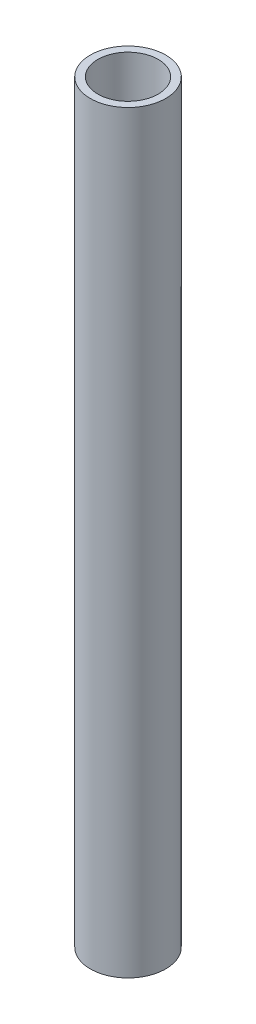
ISO-10303-21;
HEADER;
FILE_DESCRIPTION(('STEP AP214'),'2;1');
FILE_NAME('part.step','',(''),(''),'','','');
FILE_SCHEMA(('AUTOMOTIVE_DESIGN { 1 0 10303 214 1 1 1 1 }'));
ENDSEC;
DATA;
#1=APPLICATION_CONTEXT('core data for automotive mechanical design processes');
#2=APPLICATION_PROTOCOL_DEFINITION('international standard','automotive_design',2000,#1);
#3=PRODUCT_CONTEXT('',#1,'mechanical');
#4=PRODUCT('Part','Part','',(#3));
#5=PRODUCT_RELATED_PRODUCT_CATEGORY('part','',(#4));
#6=PRODUCT_DEFINITION_FORMATION('','',#4);
#7=PRODUCT_DEFINITION_CONTEXT('part definition',#1,'design');
#8=PRODUCT_DEFINITION('design','',#6,#7);
#9=PRODUCT_DEFINITION_SHAPE('','',#8);
#10=(LENGTH_UNIT() NAMED_UNIT(*) SI_UNIT(.MILLI.,.METRE.));
#11=(NAMED_UNIT(*) PLANE_ANGLE_UNIT() SI_UNIT($,.RADIAN.));
#12=(NAMED_UNIT(*) SI_UNIT($,.STERADIAN.) SOLID_ANGLE_UNIT());
#13=UNCERTAINTY_MEASURE_WITH_UNIT(LENGTH_MEASURE(1.E-05),#10,'distance_accuracy_value','');
#14=(GEOMETRIC_REPRESENTATION_CONTEXT(3) GLOBAL_UNCERTAINTY_ASSIGNED_CONTEXT((#13)) GLOBAL_UNIT_ASSIGNED_CONTEXT((#10,
#11,#12)) REPRESENTATION_CONTEXT('',''));
#15=CARTESIAN_POINT('',(0.,0.,0.));
#16=DIRECTION('',(0.,0.,1.));
#17=DIRECTION('',(1.,0.,0.));
#18=AXIS2_PLACEMENT_3D('',#15,#16,#17);
#19=CARTESIAN_POINT('',(0.,-100.,0.));
#20=DIRECTION('',(0.,-1.,0.));
#21=DIRECTION('',(0.,0.,-1.));
#22=AXIS2_PLACEMENT_3D('',#19,#20,#21);
#23=CYLINDRICAL_SURFACE('',#22,8.);
#24=CARTESIAN_POINT('',(0.,-200.,0.));
#25=DIRECTION('',(0.,-1.,0.));
#26=DIRECTION('',(0.,0.,-1.));
#27=AXIS2_PLACEMENT_3D('',#24,#25,#26);
#28=CIRCLE('',#27,8.);
#29=CARTESIAN_POINT('',(0.,-200.,-8.));
#30=VERTEX_POINT('',#29);
#31=EDGE_CURVE('E26',#30,#30,#28,.F.);
#32=ORIENTED_EDGE('',*,*,#31,.F.);
#33=EDGE_LOOP('',(#32));
#34=FACE_BOUND('',#33,.T.);
#35=CARTESIAN_POINT('',(0.,0.,0.));
#36=DIRECTION('',(0.,-1.,0.));
#37=DIRECTION('',(0.,0.,-1.));
#38=AXIS2_PLACEMENT_3D('',#35,#36,#37);
#39=CIRCLE('',#38,8.);
#40=CARTESIAN_POINT('',(0.,0.,-8.));
#41=VERTEX_POINT('',#40);
#42=EDGE_CURVE('E17',#41,#41,#39,.T.);
#43=ORIENTED_EDGE('',*,*,#42,.F.);
#44=EDGE_LOOP('',(#43));
#45=FACE_BOUND('',#44,.T.);
#46=ADVANCED_FACE('F14',(#34,#45),#23,.F.);
#47=CARTESIAN_POINT('',(0.,0.,0.));
#48=DIRECTION('',(0.,1.,0.));
#49=DIRECTION('',(0.,0.,1.));
#50=AXIS2_PLACEMENT_3D('',#47,#48,#49);
#51=PLANE('',#50);
#52=CARTESIAN_POINT('',(0.,0.,0.));
#53=DIRECTION('',(0.,-1.,0.));
#54=DIRECTION('',(0.,0.,-1.));
#55=AXIS2_PLACEMENT_3D('',#52,#53,#54);
#56=CIRCLE('',#55,10.);
#57=CARTESIAN_POINT('',(0.,0.,-10.));
#58=VERTEX_POINT('',#57);
#59=EDGE_CURVE('E21',#58,#58,#56,.T.);
#60=ORIENTED_EDGE('',*,*,#59,.F.);
#61=EDGE_LOOP('',(#60));
#62=FACE_BOUND('',#61,.T.);
#63=ORIENTED_EDGE('',*,*,#42,.T.);
#64=EDGE_LOOP('',(#63));
#65=FACE_BOUND('',#64,.T.);
#66=ADVANCED_FACE('F34',(#62,#65),#51,.T.);
#67=CARTESIAN_POINT('',(0.,-200.,0.));
#68=DIRECTION('',(0.,-1.,0.));
#69=DIRECTION('',(0.,0.,-1.));
#70=AXIS2_PLACEMENT_3D('',#67,#68,#69);
#71=PLANE('',#70);
#72=CARTESIAN_POINT('',(0.,-200.,0.));
#73=DIRECTION('',(0.,-1.,0.));
#74=DIRECTION('',(0.,0.,-1.));
#75=AXIS2_PLACEMENT_3D('',#72,#73,#74);
#76=CIRCLE('',#75,10.);
#77=CARTESIAN_POINT('',(0.,-200.,-10.));
#78=VERTEX_POINT('',#77);
#79=EDGE_CURVE('E9',#78,#78,#76,.F.);
#80=ORIENTED_EDGE('',*,*,#79,.F.);
#81=EDGE_LOOP('',(#80));
#82=FACE_BOUND('',#81,.T.);
#83=ORIENTED_EDGE('',*,*,#31,.T.);
#84=EDGE_LOOP('',(#83));
#85=FACE_BOUND('',#84,.T.);
#86=ADVANCED_FACE('F42',(#82,#85),#71,.T.);
#87=CARTESIAN_POINT('',(0.,-100.,0.));
#88=DIRECTION('',(0.,-1.,0.));
#89=DIRECTION('',(0.,0.,-1.));
#90=AXIS2_PLACEMENT_3D('',#87,#88,#89);
#91=CYLINDRICAL_SURFACE('',#90,10.);
#92=ORIENTED_EDGE('',*,*,#59,.T.);
#93=EDGE_LOOP('',(#92));
#94=FACE_BOUND('',#93,.T.);
#95=ORIENTED_EDGE('',*,*,#79,.T.);
#96=EDGE_LOOP('',(#95));
#97=FACE_BOUND('',#96,.T.);
#98=ADVANCED_FACE('F44',(#94,#97),#91,.T.);
#99=CLOSED_SHELL('',(#46,#66,#86,#98));
#100=MANIFOLD_SOLID_BREP('B1',#99);
#101=ADVANCED_BREP_SHAPE_REPRESENTATION('',(#18,#100),#14);
#102=SHAPE_DEFINITION_REPRESENTATION(#9,#101);
ENDSEC;
END-ISO-10303-21;
